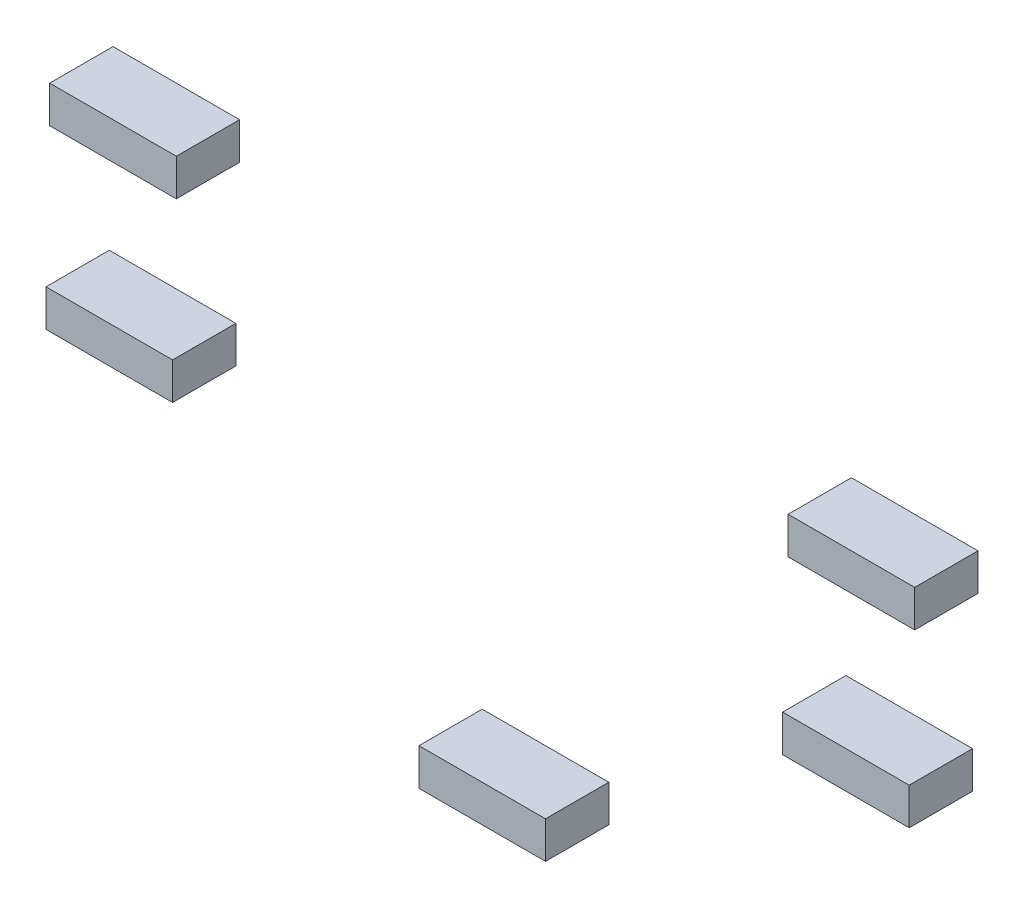
ISO-10303-21;
HEADER;
FILE_DESCRIPTION(('STEP AP214'),'2;1');
FILE_NAME('part.step','',(''),(''),'','','');
FILE_SCHEMA(('AUTOMOTIVE_DESIGN { 1 0 10303 214 1 1 1 1 }'));
ENDSEC;
DATA;
#1=APPLICATION_CONTEXT('core data for automotive mechanical design processes');
#2=APPLICATION_PROTOCOL_DEFINITION('international standard','automotive_design',2000,#1);
#3=PRODUCT_CONTEXT('',#1,'mechanical');
#4=PRODUCT('Part','Part','',(#3));
#5=PRODUCT_RELATED_PRODUCT_CATEGORY('part','',(#4));
#6=PRODUCT_DEFINITION_FORMATION('','',#4);
#7=PRODUCT_DEFINITION_CONTEXT('part definition',#1,'design');
#8=PRODUCT_DEFINITION('design','',#6,#7);
#9=PRODUCT_DEFINITION_SHAPE('','',#8);
#10=(LENGTH_UNIT() NAMED_UNIT(*) SI_UNIT(.MILLI.,.METRE.));
#11=(NAMED_UNIT(*) PLANE_ANGLE_UNIT() SI_UNIT($,.RADIAN.));
#12=(NAMED_UNIT(*) SI_UNIT($,.STERADIAN.) SOLID_ANGLE_UNIT());
#13=UNCERTAINTY_MEASURE_WITH_UNIT(LENGTH_MEASURE(1.E-05),#10,'distance_accuracy_value','');
#14=(GEOMETRIC_REPRESENTATION_CONTEXT(3) GLOBAL_UNCERTAINTY_ASSIGNED_CONTEXT((#13)) GLOBAL_UNIT_ASSIGNED_CONTEXT((#10,
#11,#12)) REPRESENTATION_CONTEXT('',''));
#15=CARTESIAN_POINT('',(0.,0.,0.));
#16=DIRECTION('',(0.,0.,1.));
#17=DIRECTION('',(1.,0.,0.));
#18=AXIS2_PLACEMENT_3D('',#15,#16,#17);
#19=CARTESIAN_POINT('',(62801.8191802713,25766.4437060881,600.));
#20=DIRECTION('',(1.,0.,0.));
#21=DIRECTION('',(0.,1.,0.));
#22=AXIS2_PLACEMENT_3D('',#19,#20,#21);
#23=PLANE('',#22);
#24=DIRECTION('',(0.,-1.,0.));
#25=VECTOR('',#24,1.);
#26=CARTESIAN_POINT('',(62801.8191802713,25766.4437060881,0.));
#27=LINE('',#26,#25);
#28=CARTESIAN_POINT('',(62801.8191802713,25766.4437060881,0.));
#29=VERTEX_POINT('',#28);
#30=CARTESIAN_POINT('',(62801.8191802713,25416.4437060881,0.));
#31=VERTEX_POINT('',#30);
#32=EDGE_CURVE('E105',#29,#31,#27,.T.);
#33=ORIENTED_EDGE('',*,*,#32,.T.);
#34=DIRECTION('',(0.,0.,-1.));
#35=VECTOR('',#34,1.);
#36=CARTESIAN_POINT('',(62801.8191802713,25416.4437060881,600.));
#37=LINE('',#36,#35);
#38=CARTESIAN_POINT('',(62801.8191802713,25416.4437060881,600.));
#39=VERTEX_POINT('',#38);
#40=EDGE_CURVE('E12',#39,#31,#37,.T.);
#41=ORIENTED_EDGE('',*,*,#40,.F.);
#42=DIRECTION('',(0.,-1.,0.));
#43=VECTOR('',#42,1.);
#44=CARTESIAN_POINT('',(62801.8191802713,25766.4437060881,600.));
#45=LINE('',#44,#43);
#46=CARTESIAN_POINT('',(62801.8191802713,25766.4437060881,600.));
#47=VERTEX_POINT('',#46);
#48=EDGE_CURVE('E93',#47,#39,#45,.T.);
#49=ORIENTED_EDGE('',*,*,#48,.F.);
#50=DIRECTION('',(0.,0.,-1.));
#51=VECTOR('',#50,1.);
#52=CARTESIAN_POINT('',(62801.8191802713,25766.4437060881,600.));
#53=LINE('',#52,#51);
#54=EDGE_CURVE('E101',#47,#29,#53,.T.);
#55=ORIENTED_EDGE('',*,*,#54,.T.);
#56=EDGE_LOOP('',(#33,#41,#49,#55));
#57=FACE_BOUND('',#56,.T.);
#58=ADVANCED_FACE('F42',(#57),#23,.F.);
#59=CARTESIAN_POINT('',(62801.8191802713,25416.4437060881,600.));
#60=DIRECTION('',(0.,1.,0.));
#61=DIRECTION('',(0.,0.,1.));
#62=AXIS2_PLACEMENT_3D('',#59,#60,#61);
#63=PLANE('',#62);
#64=DIRECTION('',(1.,0.,0.));
#65=VECTOR('',#64,1.);
#66=CARTESIAN_POINT('',(62801.8191802713,25416.4437060881,0.));
#67=LINE('',#66,#65);
#68=CARTESIAN_POINT('',(64001.8191802713,25416.4437060881,0.));
#69=VERTEX_POINT('',#68);
#70=EDGE_CURVE('E97',#31,#69,#67,.T.);
#71=ORIENTED_EDGE('',*,*,#70,.T.);
#72=DIRECTION('',(0.,0.,-1.));
#73=VECTOR('',#72,1.);
#74=CARTESIAN_POINT('',(64001.8191802713,25416.4437060881,600.));
#75=LINE('',#74,#73);
#76=CARTESIAN_POINT('',(64001.8191802713,25416.4437060881,600.));
#77=VERTEX_POINT('',#76);
#78=EDGE_CURVE('E50',#77,#69,#75,.T.);
#79=ORIENTED_EDGE('',*,*,#78,.F.);
#80=DIRECTION('',(1.,0.,0.));
#81=VECTOR('',#80,1.);
#82=CARTESIAN_POINT('',(62801.8191802713,25416.4437060881,600.));
#83=LINE('',#82,#81);
#84=EDGE_CURVE('E88',#39,#77,#83,.T.);
#85=ORIENTED_EDGE('',*,*,#84,.F.);
#86=ORIENTED_EDGE('',*,*,#40,.T.);
#87=EDGE_LOOP('',(#71,#79,#85,#86));
#88=FACE_BOUND('',#87,.T.);
#89=ADVANCED_FACE('F96',(#88),#63,.F.);
#90=CARTESIAN_POINT('',(64001.8191802713,25766.4437060881,600.));
#91=DIRECTION('',(-1.,0.,0.));
#92=DIRECTION('',(0.,0.,1.));
#93=AXIS2_PLACEMENT_3D('',#90,#91,#92);
#94=PLANE('',#93);
#95=DIRECTION('',(0.,1.,0.));
#96=VECTOR('',#95,1.);
#97=CARTESIAN_POINT('',(64001.8191802713,25766.4437060881,0.));
#98=LINE('',#97,#96);
#99=CARTESIAN_POINT('',(64001.8191802713,25766.4437060881,0.));
#100=VERTEX_POINT('',#99);
#101=EDGE_CURVE('E75',#69,#100,#98,.T.);
#102=ORIENTED_EDGE('',*,*,#101,.T.);
#103=DIRECTION('',(0.,0.,-1.));
#104=VECTOR('',#103,1.);
#105=CARTESIAN_POINT('',(64001.8191802713,25766.4437060881,600.));
#106=LINE('',#105,#104);
#107=CARTESIAN_POINT('',(64001.8191802713,25766.4437060881,600.));
#108=VERTEX_POINT('',#107);
#109=EDGE_CURVE('E98',#108,#100,#106,.T.);
#110=ORIENTED_EDGE('',*,*,#109,.F.);
#111=DIRECTION('',(0.,1.,0.));
#112=VECTOR('',#111,1.);
#113=CARTESIAN_POINT('',(64001.8191802713,25766.4437060881,600.));
#114=LINE('',#113,#112);
#115=EDGE_CURVE('E91',#77,#108,#114,.T.);
#116=ORIENTED_EDGE('',*,*,#115,.F.);
#117=ORIENTED_EDGE('',*,*,#78,.T.);
#118=EDGE_LOOP('',(#102,#110,#116,#117));
#119=FACE_BOUND('',#118,.T.);
#120=ADVANCED_FACE('F99',(#119),#94,.F.);
#121=CARTESIAN_POINT('',(62801.8191802713,25766.4437060881,600.));
#122=DIRECTION('',(0.,-1.,0.));
#123=DIRECTION('',(0.,0.,-1.));
#124=AXIS2_PLACEMENT_3D('',#121,#122,#123);
#125=PLANE('',#124);
#126=DIRECTION('',(-1.,0.,0.));
#127=VECTOR('',#126,1.);
#128=CARTESIAN_POINT('',(62801.8191802713,25766.4437060881,0.));
#129=LINE('',#128,#127);
#130=EDGE_CURVE('E81',#100,#29,#129,.T.);
#131=ORIENTED_EDGE('',*,*,#130,.T.);
#132=ORIENTED_EDGE('',*,*,#54,.F.);
#133=DIRECTION('',(-1.,0.,0.));
#134=VECTOR('',#133,1.);
#135=CARTESIAN_POINT('',(62801.8191802713,25766.4437060881,600.));
#136=LINE('',#135,#134);
#137=EDGE_CURVE('E58',#108,#47,#136,.T.);
#138=ORIENTED_EDGE('',*,*,#137,.F.);
#139=ORIENTED_EDGE('',*,*,#109,.T.);
#140=EDGE_LOOP('',(#131,#132,#138,#139));
#141=FACE_BOUND('',#140,.T.);
#142=ADVANCED_FACE('F112',(#141),#125,.F.);
#143=CARTESIAN_POINT('',(62801.8191802713,25416.4437060881,600.));
#144=DIRECTION('',(0.,0.,1.));
#145=DIRECTION('',(1.,0.,0.));
#146=AXIS2_PLACEMENT_3D('',#143,#144,#145);
#147=PLANE('',#146);
#148=ORIENTED_EDGE('',*,*,#48,.T.);
#149=ORIENTED_EDGE('',*,*,#84,.T.);
#150=ORIENTED_EDGE('',*,*,#115,.T.);
#151=ORIENTED_EDGE('',*,*,#137,.T.);
#152=EDGE_LOOP('',(#148,#149,#150,#151));
#153=FACE_BOUND('',#152,.T.);
#154=ADVANCED_FACE('F89',(#153),#147,.T.);
#155=CARTESIAN_POINT('',(62801.8191802713,25416.4437060881,0.));
#156=DIRECTION('',(0.,0.,1.));
#157=DIRECTION('',(1.,0.,0.));
#158=AXIS2_PLACEMENT_3D('',#155,#156,#157);
#159=PLANE('',#158);
#160=ORIENTED_EDGE('',*,*,#32,.F.);
#161=ORIENTED_EDGE('',*,*,#130,.F.);
#162=ORIENTED_EDGE('',*,*,#101,.F.);
#163=ORIENTED_EDGE('',*,*,#70,.F.);
#164=EDGE_LOOP('',(#160,#161,#162,#163));
#165=FACE_BOUND('',#164,.T.);
#166=ADVANCED_FACE('F115',(#165),#159,.F.);
#167=CLOSED_SHELL('',(#58,#89,#120,#142,#154,#166));
#168=MANIFOLD_SOLID_BREP('B2',#167);
#169=CARTESIAN_POINT('',(64037.0577376786,27106.1703648012,600.));
#170=DIRECTION('',(-1.,0.,0.));
#171=DIRECTION('',(0.,0.,1.));
#172=AXIS2_PLACEMENT_3D('',#169,#170,#171);
#173=PLANE('',#172);
#174=DIRECTION('',(0.,1.,0.));
#175=VECTOR('',#174,1.);
#176=CARTESIAN_POINT('',(64037.0577376786,27106.1703648012,0.));
#177=LINE('',#176,#175);
#178=CARTESIAN_POINT('',(64037.0577376786,27106.1703648012,0.));
#179=VERTEX_POINT('',#178);
#180=CARTESIAN_POINT('',(64037.0577376786,27456.1703648012,0.));
#181=VERTEX_POINT('',#180);
#182=EDGE_CURVE('E239',#179,#181,#177,.T.);
#183=ORIENTED_EDGE('',*,*,#182,.T.);
#184=DIRECTION('',(0.,0.,-1.));
#185=VECTOR('',#184,1.);
#186=CARTESIAN_POINT('',(64037.0577376786,27456.1703648012,600.));
#187=LINE('',#186,#185);
#188=CARTESIAN_POINT('',(64037.0577376786,27456.1703648012,600.));
#189=VERTEX_POINT('',#188);
#190=EDGE_CURVE('E40',#189,#181,#187,.T.);
#191=ORIENTED_EDGE('',*,*,#190,.F.);
#192=DIRECTION('',(0.,1.,0.));
#193=VECTOR('',#192,1.);
#194=CARTESIAN_POINT('',(64037.0577376786,27106.1703648012,600.));
#195=LINE('',#194,#193);
#196=CARTESIAN_POINT('',(64037.0577376786,27106.1703648012,600.));
#197=VERTEX_POINT('',#196);
#198=EDGE_CURVE('E227',#197,#189,#195,.T.);
#199=ORIENTED_EDGE('',*,*,#198,.F.);
#200=DIRECTION('',(0.,0.,-1.));
#201=VECTOR('',#200,1.);
#202=CARTESIAN_POINT('',(64037.0577376786,27106.1703648012,600.));
#203=LINE('',#202,#201);
#204=EDGE_CURVE('E235',#197,#179,#203,.T.);
#205=ORIENTED_EDGE('',*,*,#204,.T.);
#206=EDGE_LOOP('',(#183,#191,#199,#205));
#207=FACE_BOUND('',#206,.T.);
#208=ADVANCED_FACE('F176',(#207),#173,.F.);
#209=CARTESIAN_POINT('',(64037.0577376786,27456.1703648012,600.));
#210=DIRECTION('',(0.,-1.,0.));
#211=DIRECTION('',(0.,0.,-1.));
#212=AXIS2_PLACEMENT_3D('',#209,#210,#211);
#213=PLANE('',#212);
#214=DIRECTION('',(-1.,0.,0.));
#215=VECTOR('',#214,1.);
#216=CARTESIAN_POINT('',(64037.0577376786,27456.1703648012,0.));
#217=LINE('',#216,#215);
#218=CARTESIAN_POINT('',(62837.0577376786,27456.1703648012,0.));
#219=VERTEX_POINT('',#218);
#220=EDGE_CURVE('E231',#181,#219,#217,.T.);
#221=ORIENTED_EDGE('',*,*,#220,.T.);
#222=DIRECTION('',(0.,0.,-1.));
#223=VECTOR('',#222,1.);
#224=CARTESIAN_POINT('',(62837.0577376786,27456.1703648012,600.));
#225=LINE('',#224,#223);
#226=CARTESIAN_POINT('',(62837.0577376786,27456.1703648012,600.));
#227=VERTEX_POINT('',#226);
#228=EDGE_CURVE('E184',#227,#219,#225,.T.);
#229=ORIENTED_EDGE('',*,*,#228,.F.);
#230=DIRECTION('',(-1.,0.,0.));
#231=VECTOR('',#230,1.);
#232=CARTESIAN_POINT('',(64037.0577376786,27456.1703648012,600.));
#233=LINE('',#232,#231);
#234=EDGE_CURVE('E222',#189,#227,#233,.T.);
#235=ORIENTED_EDGE('',*,*,#234,.F.);
#236=ORIENTED_EDGE('',*,*,#190,.T.);
#237=EDGE_LOOP('',(#221,#229,#235,#236));
#238=FACE_BOUND('',#237,.T.);
#239=ADVANCED_FACE('F230',(#238),#213,.F.);
#240=CARTESIAN_POINT('',(62837.0577376786,27106.1703648012,600.));
#241=DIRECTION('',(1.,0.,0.));
#242=DIRECTION('',(0.,0.,-1.));
#243=AXIS2_PLACEMENT_3D('',#240,#241,#242);
#244=PLANE('',#243);
#245=DIRECTION('',(0.,-1.,0.));
#246=VECTOR('',#245,1.);
#247=CARTESIAN_POINT('',(62837.0577376786,27106.1703648012,0.));
#248=LINE('',#247,#246);
#249=CARTESIAN_POINT('',(62837.0577376786,27106.1703648012,0.));
#250=VERTEX_POINT('',#249);
#251=EDGE_CURVE('E209',#219,#250,#248,.T.);
#252=ORIENTED_EDGE('',*,*,#251,.T.);
#253=DIRECTION('',(0.,0.,-1.));
#254=VECTOR('',#253,1.);
#255=CARTESIAN_POINT('',(62837.0577376786,27106.1703648012,600.));
#256=LINE('',#255,#254);
#257=CARTESIAN_POINT('',(62837.0577376786,27106.1703648012,600.));
#258=VERTEX_POINT('',#257);
#259=EDGE_CURVE('E232',#258,#250,#256,.T.);
#260=ORIENTED_EDGE('',*,*,#259,.F.);
#261=DIRECTION('',(0.,-1.,0.));
#262=VECTOR('',#261,1.);
#263=CARTESIAN_POINT('',(62837.0577376786,27106.1703648012,600.));
#264=LINE('',#263,#262);
#265=EDGE_CURVE('E225',#227,#258,#264,.T.);
#266=ORIENTED_EDGE('',*,*,#265,.F.);
#267=ORIENTED_EDGE('',*,*,#228,.T.);
#268=EDGE_LOOP('',(#252,#260,#266,#267));
#269=FACE_BOUND('',#268,.T.);
#270=ADVANCED_FACE('F233',(#269),#244,.F.);
#271=CARTESIAN_POINT('',(64037.0577376786,27106.1703648012,600.));
#272=DIRECTION('',(0.,1.,0.));
#273=DIRECTION('',(0.,0.,1.));
#274=AXIS2_PLACEMENT_3D('',#271,#272,#273);
#275=PLANE('',#274);
#276=DIRECTION('',(1.,0.,0.));
#277=VECTOR('',#276,1.);
#278=CARTESIAN_POINT('',(64037.0577376786,27106.1703648012,0.));
#279=LINE('',#278,#277);
#280=EDGE_CURVE('E215',#250,#179,#279,.T.);
#281=ORIENTED_EDGE('',*,*,#280,.T.);
#282=ORIENTED_EDGE('',*,*,#204,.F.);
#283=DIRECTION('',(1.,0.,0.));
#284=VECTOR('',#283,1.);
#285=CARTESIAN_POINT('',(64037.0577376786,27106.1703648012,600.));
#286=LINE('',#285,#284);
#287=EDGE_CURVE('E192',#258,#197,#286,.T.);
#288=ORIENTED_EDGE('',*,*,#287,.F.);
#289=ORIENTED_EDGE('',*,*,#259,.T.);
#290=EDGE_LOOP('',(#281,#282,#288,#289));
#291=FACE_BOUND('',#290,.T.);
#292=ADVANCED_FACE('F246',(#291),#275,.F.);
#293=CARTESIAN_POINT('',(64037.0577376786,27456.1703648012,600.));
#294=DIRECTION('',(0.,0.,1.));
#295=DIRECTION('',(1.,0.,0.));
#296=AXIS2_PLACEMENT_3D('',#293,#294,#295);
#297=PLANE('',#296);
#298=ORIENTED_EDGE('',*,*,#198,.T.);
#299=ORIENTED_EDGE('',*,*,#234,.T.);
#300=ORIENTED_EDGE('',*,*,#265,.T.);
#301=ORIENTED_EDGE('',*,*,#287,.T.);
#302=EDGE_LOOP('',(#298,#299,#300,#301));
#303=FACE_BOUND('',#302,.T.);
#304=ADVANCED_FACE('F223',(#303),#297,.T.);
#305=CARTESIAN_POINT('',(64037.0577376786,27456.1703648012,0.));
#306=DIRECTION('',(0.,0.,1.));
#307=DIRECTION('',(1.,0.,0.));
#308=AXIS2_PLACEMENT_3D('',#305,#306,#307);
#309=PLANE('',#308);
#310=ORIENTED_EDGE('',*,*,#182,.F.);
#311=ORIENTED_EDGE('',*,*,#280,.F.);
#312=ORIENTED_EDGE('',*,*,#251,.F.);
#313=ORIENTED_EDGE('',*,*,#220,.F.);
#314=EDGE_LOOP('',(#310,#311,#312,#313));
#315=FACE_BOUND('',#314,.T.);
#316=ADVANCED_FACE('F249',(#315),#309,.F.);
#317=CLOSED_SHELL('',(#208,#239,#270,#292,#304,#316));
#318=MANIFOLD_SOLID_BREP('B6',#317);
#319=CARTESIAN_POINT('',(71037.0577376786,27066.6336256256,600.));
#320=DIRECTION('',(-1.,0.,0.));
#321=DIRECTION('',(0.,-1.,0.));
#322=AXIS2_PLACEMENT_3D('',#319,#320,#321);
#323=PLANE('',#322);
#324=DIRECTION('',(0.,1.,0.));
#325=VECTOR('',#324,1.);
#326=CARTESIAN_POINT('',(71037.0577376786,27066.6336256256,0.));
#327=LINE('',#326,#325);
#328=CARTESIAN_POINT('',(71037.0577376786,27066.6336256256,0.));
#329=VERTEX_POINT('',#328);
#330=CARTESIAN_POINT('',(71037.0577376786,27416.6336256256,0.));
#331=VERTEX_POINT('',#330);
#332=EDGE_CURVE('E373',#329,#331,#327,.T.);
#333=ORIENTED_EDGE('',*,*,#332,.T.);
#334=DIRECTION('',(0.,0.,-1.));
#335=VECTOR('',#334,1.);
#336=CARTESIAN_POINT('',(71037.0577376786,27416.6336256256,600.));
#337=LINE('',#336,#335);
#338=CARTESIAN_POINT('',(71037.0577376786,27416.6336256256,600.));
#339=VERTEX_POINT('',#338);
#340=EDGE_CURVE('E174',#339,#331,#337,.T.);
#341=ORIENTED_EDGE('',*,*,#340,.F.);
#342=DIRECTION('',(0.,1.,0.));
#343=VECTOR('',#342,1.);
#344=CARTESIAN_POINT('',(71037.0577376786,27066.6336256256,600.));
#345=LINE('',#344,#343);
#346=CARTESIAN_POINT('',(71037.0577376786,27066.6336256256,600.));
#347=VERTEX_POINT('',#346);
#348=EDGE_CURVE('E361',#347,#339,#345,.T.);
#349=ORIENTED_EDGE('',*,*,#348,.F.);
#350=DIRECTION('',(0.,0.,-1.));
#351=VECTOR('',#350,1.);
#352=CARTESIAN_POINT('',(71037.0577376786,27066.6336256256,600.));
#353=LINE('',#352,#351);
#354=EDGE_CURVE('E369',#347,#329,#353,.T.);
#355=ORIENTED_EDGE('',*,*,#354,.T.);
#356=EDGE_LOOP('',(#333,#341,#349,#355));
#357=FACE_BOUND('',#356,.T.);
#358=ADVANCED_FACE('F310',(#357),#323,.F.);
#359=CARTESIAN_POINT('',(71037.0577376786,27416.6336256256,600.));
#360=DIRECTION('',(0.,-1.,0.));
#361=DIRECTION('',(0.,0.,-1.));
#362=AXIS2_PLACEMENT_3D('',#359,#360,#361);
#363=PLANE('',#362);
#364=DIRECTION('',(-1.,0.,0.));
#365=VECTOR('',#364,1.);
#366=CARTESIAN_POINT('',(71037.0577376786,27416.6336256256,0.));
#367=LINE('',#366,#365);
#368=CARTESIAN_POINT('',(69837.0577376786,27416.6336256256,0.));
#369=VERTEX_POINT('',#368);
#370=EDGE_CURVE('E365',#331,#369,#367,.T.);
#371=ORIENTED_EDGE('',*,*,#370,.T.);
#372=DIRECTION('',(0.,0.,-1.));
#373=VECTOR('',#372,1.);
#374=CARTESIAN_POINT('',(69837.0577376786,27416.6336256256,600.));
#375=LINE('',#374,#373);
#376=CARTESIAN_POINT('',(69837.0577376786,27416.6336256256,600.));
#377=VERTEX_POINT('',#376);
#378=EDGE_CURVE('E318',#377,#369,#375,.T.);
#379=ORIENTED_EDGE('',*,*,#378,.F.);
#380=DIRECTION('',(-1.,0.,0.));
#381=VECTOR('',#380,1.);
#382=CARTESIAN_POINT('',(71037.0577376786,27416.6336256256,600.));
#383=LINE('',#382,#381);
#384=EDGE_CURVE('E356',#339,#377,#383,.T.);
#385=ORIENTED_EDGE('',*,*,#384,.F.);
#386=ORIENTED_EDGE('',*,*,#340,.T.);
#387=EDGE_LOOP('',(#371,#379,#385,#386));
#388=FACE_BOUND('',#387,.T.);
#389=ADVANCED_FACE('F364',(#388),#363,.F.);
#390=CARTESIAN_POINT('',(69837.0577376786,27066.6336256256,600.));
#391=DIRECTION('',(1.,0.,0.));
#392=DIRECTION('',(0.,1.,0.));
#393=AXIS2_PLACEMENT_3D('',#390,#391,#392);
#394=PLANE('',#393);
#395=DIRECTION('',(0.,-1.,0.));
#396=VECTOR('',#395,1.);
#397=CARTESIAN_POINT('',(69837.0577376786,27066.6336256256,0.));
#398=LINE('',#397,#396);
#399=CARTESIAN_POINT('',(69837.0577376786,27066.6336256256,0.));
#400=VERTEX_POINT('',#399);
#401=EDGE_CURVE('E343',#369,#400,#398,.T.);
#402=ORIENTED_EDGE('',*,*,#401,.T.);
#403=DIRECTION('',(0.,0.,-1.));
#404=VECTOR('',#403,1.);
#405=CARTESIAN_POINT('',(69837.0577376786,27066.6336256256,600.));
#406=LINE('',#405,#404);
#407=CARTESIAN_POINT('',(69837.0577376786,27066.6336256256,600.));
#408=VERTEX_POINT('',#407);
#409=EDGE_CURVE('E366',#408,#400,#406,.T.);
#410=ORIENTED_EDGE('',*,*,#409,.F.);
#411=DIRECTION('',(0.,-1.,0.));
#412=VECTOR('',#411,1.);
#413=CARTESIAN_POINT('',(69837.0577376786,27066.6336256256,600.));
#414=LINE('',#413,#412);
#415=EDGE_CURVE('E359',#377,#408,#414,.T.);
#416=ORIENTED_EDGE('',*,*,#415,.F.);
#417=ORIENTED_EDGE('',*,*,#378,.T.);
#418=EDGE_LOOP('',(#402,#410,#416,#417));
#419=FACE_BOUND('',#418,.T.);
#420=ADVANCED_FACE('F367',(#419),#394,.F.);
#421=CARTESIAN_POINT('',(71037.0577376786,27066.6336256256,600.));
#422=DIRECTION('',(0.,1.,0.));
#423=DIRECTION('',(0.,0.,1.));
#424=AXIS2_PLACEMENT_3D('',#421,#422,#423);
#425=PLANE('',#424);
#426=DIRECTION('',(1.,0.,0.));
#427=VECTOR('',#426,1.);
#428=CARTESIAN_POINT('',(71037.0577376786,27066.6336256256,0.));
#429=LINE('',#428,#427);
#430=EDGE_CURVE('E349',#400,#329,#429,.T.);
#431=ORIENTED_EDGE('',*,*,#430,.T.);
#432=ORIENTED_EDGE('',*,*,#354,.F.);
#433=DIRECTION('',(1.,0.,0.));
#434=VECTOR('',#433,1.);
#435=CARTESIAN_POINT('',(71037.0577376786,27066.6336256256,600.));
#436=LINE('',#435,#434);
#437=EDGE_CURVE('E326',#408,#347,#436,.T.);
#438=ORIENTED_EDGE('',*,*,#437,.F.);
#439=ORIENTED_EDGE('',*,*,#409,.T.);
#440=EDGE_LOOP('',(#431,#432,#438,#439));
#441=FACE_BOUND('',#440,.T.);
#442=ADVANCED_FACE('F380',(#441),#425,.F.);
#443=CARTESIAN_POINT('',(71037.0577376786,27416.6336256256,600.));
#444=DIRECTION('',(0.,0.,1.));
#445=DIRECTION('',(1.,0.,0.));
#446=AXIS2_PLACEMENT_3D('',#443,#444,#445);
#447=PLANE('',#446);
#448=ORIENTED_EDGE('',*,*,#348,.T.);
#449=ORIENTED_EDGE('',*,*,#384,.T.);
#450=ORIENTED_EDGE('',*,*,#415,.T.);
#451=ORIENTED_EDGE('',*,*,#437,.T.);
#452=EDGE_LOOP('',(#448,#449,#450,#451));
#453=FACE_BOUND('',#452,.T.);
#454=ADVANCED_FACE('F357',(#453),#447,.T.);
#455=CARTESIAN_POINT('',(71037.0577376786,27416.6336256256,0.));
#456=DIRECTION('',(0.,0.,1.));
#457=DIRECTION('',(1.,0.,0.));
#458=AXIS2_PLACEMENT_3D('',#455,#456,#457);
#459=PLANE('',#458);
#460=ORIENTED_EDGE('',*,*,#332,.F.);
#461=ORIENTED_EDGE('',*,*,#430,.F.);
#462=ORIENTED_EDGE('',*,*,#401,.F.);
#463=ORIENTED_EDGE('',*,*,#370,.F.);
#464=EDGE_LOOP('',(#460,#461,#462,#463));
#465=FACE_BOUND('',#464,.T.);
#466=ADVANCED_FACE('F383',(#465),#459,.F.);
#467=CLOSED_SHELL('',(#358,#389,#420,#442,#454,#466));
#468=MANIFOLD_SOLID_BREP('B34',#467);
#469=CARTESIAN_POINT('',(69785.142636984,25766.6336256256,600.));
#470=DIRECTION('',(1.,0.,0.));
#471=DIRECTION('',(0.,0.,-1.));
#472=AXIS2_PLACEMENT_3D('',#469,#470,#471);
#473=PLANE('',#472);
#474=DIRECTION('',(0.,-1.,0.));
#475=VECTOR('',#474,1.);
#476=CARTESIAN_POINT('',(69785.142636984,25766.6336256256,0.));
#477=LINE('',#476,#475);
#478=CARTESIAN_POINT('',(69785.142636984,25766.6336256256,0.));
#479=VERTEX_POINT('',#478);
#480=CARTESIAN_POINT('',(69785.142636984,25416.6336256256,0.));
#481=VERTEX_POINT('',#480);
#482=EDGE_CURVE('E506',#479,#481,#477,.T.);
#483=ORIENTED_EDGE('',*,*,#482,.T.);
#484=DIRECTION('',(0.,0.,-1.));
#485=VECTOR('',#484,1.);
#486=CARTESIAN_POINT('',(69785.142636984,25416.6336256256,600.));
#487=LINE('',#486,#485);
#488=CARTESIAN_POINT('',(69785.142636984,25416.6336256256,600.));
#489=VERTEX_POINT('',#488);
#490=EDGE_CURVE('E308',#489,#481,#487,.T.);
#491=ORIENTED_EDGE('',*,*,#490,.F.);
#492=DIRECTION('',(0.,-1.,0.));
#493=VECTOR('',#492,1.);
#494=CARTESIAN_POINT('',(69785.142636984,25766.6336256256,600.));
#495=LINE('',#494,#493);
#496=CARTESIAN_POINT('',(69785.142636984,25766.6336256256,600.));
#497=VERTEX_POINT('',#496);
#498=EDGE_CURVE('E494',#497,#489,#495,.T.);
#499=ORIENTED_EDGE('',*,*,#498,.F.);
#500=DIRECTION('',(0.,0.,-1.));
#501=VECTOR('',#500,1.);
#502=CARTESIAN_POINT('',(69785.142636984,25766.6336256256,600.));
#503=LINE('',#502,#501);
#504=EDGE_CURVE('E502',#497,#479,#503,.T.);
#505=ORIENTED_EDGE('',*,*,#504,.T.);
#506=EDGE_LOOP('',(#483,#491,#499,#505));
#507=FACE_BOUND('',#506,.T.);
#508=ADVANCED_FACE('F443',(#507),#473,.F.);
#509=CARTESIAN_POINT('',(69785.142636984,25416.6336256256,600.));
#510=DIRECTION('',(0.,1.,0.));
#511=DIRECTION('',(0.,0.,1.));
#512=AXIS2_PLACEMENT_3D('',#509,#510,#511);
#513=PLANE('',#512);
#514=DIRECTION('',(1.,0.,0.));
#515=VECTOR('',#514,1.);
#516=CARTESIAN_POINT('',(69785.142636984,25416.6336256256,0.));
#517=LINE('',#516,#515);
#518=CARTESIAN_POINT('',(70985.142636984,25416.6336256256,0.));
#519=VERTEX_POINT('',#518);
#520=EDGE_CURVE('E498',#481,#519,#517,.T.);
#521=ORIENTED_EDGE('',*,*,#520,.T.);
#522=DIRECTION('',(0.,0.,-1.));
#523=VECTOR('',#522,1.);
#524=CARTESIAN_POINT('',(70985.142636984,25416.6336256256,600.));
#525=LINE('',#524,#523);
#526=CARTESIAN_POINT('',(70985.142636984,25416.6336256256,600.));
#527=VERTEX_POINT('',#526);
#528=EDGE_CURVE('E451',#527,#519,#525,.T.);
#529=ORIENTED_EDGE('',*,*,#528,.F.);
#530=DIRECTION('',(1.,0.,0.));
#531=VECTOR('',#530,1.);
#532=CARTESIAN_POINT('',(69785.142636984,25416.6336256256,600.));
#533=LINE('',#532,#531);
#534=EDGE_CURVE('E489',#489,#527,#533,.T.);
#535=ORIENTED_EDGE('',*,*,#534,.F.);
#536=ORIENTED_EDGE('',*,*,#490,.T.);
#537=EDGE_LOOP('',(#521,#529,#535,#536));
#538=FACE_BOUND('',#537,.T.);
#539=ADVANCED_FACE('F497',(#538),#513,.F.);
#540=CARTESIAN_POINT('',(70985.142636984,25766.6336256256,600.));
#541=DIRECTION('',(-1.,0.,0.));
#542=DIRECTION('',(0.,0.,1.));
#543=AXIS2_PLACEMENT_3D('',#540,#541,#542);
#544=PLANE('',#543);
#545=DIRECTION('',(0.,1.,0.));
#546=VECTOR('',#545,1.);
#547=CARTESIAN_POINT('',(70985.142636984,25766.6336256256,0.));
#548=LINE('',#547,#546);
#549=CARTESIAN_POINT('',(70985.142636984,25766.6336256256,0.));
#550=VERTEX_POINT('',#549);
#551=EDGE_CURVE('E476',#519,#550,#548,.T.);
#552=ORIENTED_EDGE('',*,*,#551,.T.);
#553=DIRECTION('',(0.,0.,-1.));
#554=VECTOR('',#553,1.);
#555=CARTESIAN_POINT('',(70985.142636984,25766.6336256256,600.));
#556=LINE('',#555,#554);
#557=CARTESIAN_POINT('',(70985.142636984,25766.6336256256,600.));
#558=VERTEX_POINT('',#557);
#559=EDGE_CURVE('E499',#558,#550,#556,.T.);
#560=ORIENTED_EDGE('',*,*,#559,.F.);
#561=DIRECTION('',(0.,1.,0.));
#562=VECTOR('',#561,1.);
#563=CARTESIAN_POINT('',(70985.142636984,25766.6336256256,600.));
#564=LINE('',#563,#562);
#565=EDGE_CURVE('E492',#527,#558,#564,.T.);
#566=ORIENTED_EDGE('',*,*,#565,.F.);
#567=ORIENTED_EDGE('',*,*,#528,.T.);
#568=EDGE_LOOP('',(#552,#560,#566,#567));
#569=FACE_BOUND('',#568,.T.);
#570=ADVANCED_FACE('F500',(#569),#544,.F.);
#571=CARTESIAN_POINT('',(69785.142636984,25766.6336256256,600.));
#572=DIRECTION('',(0.,-1.,0.));
#573=DIRECTION('',(0.,0.,-1.));
#574=AXIS2_PLACEMENT_3D('',#571,#572,#573);
#575=PLANE('',#574);
#576=DIRECTION('',(-1.,0.,0.));
#577=VECTOR('',#576,1.);
#578=CARTESIAN_POINT('',(69785.142636984,25766.6336256256,0.));
#579=LINE('',#578,#577);
#580=EDGE_CURVE('E482',#550,#479,#579,.T.);
#581=ORIENTED_EDGE('',*,*,#580,.T.);
#582=ORIENTED_EDGE('',*,*,#504,.F.);
#583=DIRECTION('',(-1.,0.,0.));
#584=VECTOR('',#583,1.);
#585=CARTESIAN_POINT('',(69785.142636984,25766.6336256256,600.));
#586=LINE('',#585,#584);
#587=EDGE_CURVE('E459',#558,#497,#586,.T.);
#588=ORIENTED_EDGE('',*,*,#587,.F.);
#589=ORIENTED_EDGE('',*,*,#559,.T.);
#590=EDGE_LOOP('',(#581,#582,#588,#589));
#591=FACE_BOUND('',#590,.T.);
#592=ADVANCED_FACE('F513',(#591),#575,.F.);
#593=CARTESIAN_POINT('',(69785.142636984,25416.6336256256,600.));
#594=DIRECTION('',(0.,0.,1.));
#595=DIRECTION('',(1.,0.,0.));
#596=AXIS2_PLACEMENT_3D('',#593,#594,#595);
#597=PLANE('',#596);
#598=ORIENTED_EDGE('',*,*,#498,.T.);
#599=ORIENTED_EDGE('',*,*,#534,.T.);
#600=ORIENTED_EDGE('',*,*,#565,.T.);
#601=ORIENTED_EDGE('',*,*,#587,.T.);
#602=EDGE_LOOP('',(#598,#599,#600,#601));
#603=FACE_BOUND('',#602,.T.);
#604=ADVANCED_FACE('F490',(#603),#597,.T.);
#605=CARTESIAN_POINT('',(69785.142636984,25416.6336256256,0.));
#606=DIRECTION('',(0.,0.,1.));
#607=DIRECTION('',(1.,0.,0.));
#608=AXIS2_PLACEMENT_3D('',#605,#606,#607);
#609=PLANE('',#608);
#610=ORIENTED_EDGE('',*,*,#482,.F.);
#611=ORIENTED_EDGE('',*,*,#580,.F.);
#612=ORIENTED_EDGE('',*,*,#551,.F.);
#613=ORIENTED_EDGE('',*,*,#520,.F.);
#614=EDGE_LOOP('',(#610,#611,#612,#613));
#615=FACE_BOUND('',#614,.T.);
#616=ADVANCED_FACE('F516',(#615),#609,.F.);
#617=CLOSED_SHELL('',(#508,#539,#570,#592,#604,#616));
#618=MANIFOLD_SOLID_BREP('B168',#617);
#619=CARTESIAN_POINT('',(66337.0577376786,23766.6336256256,600.));
#620=DIRECTION('',(1.,0.,0.));
#621=DIRECTION('',(0.,0.,-1.));
#622=AXIS2_PLACEMENT_3D('',#619,#620,#621);
#623=PLANE('',#622);
#624=DIRECTION('',(0.,-1.,0.));
#625=VECTOR('',#624,1.);
#626=CARTESIAN_POINT('',(66337.0577376786,23766.6336256256,0.));
#627=LINE('',#626,#625);
#628=CARTESIAN_POINT('',(66337.0577376786,23766.6336256256,0.));
#629=VERTEX_POINT('',#628);
#630=CARTESIAN_POINT('',(66337.0577376786,23416.6336256256,0.));
#631=VERTEX_POINT('',#630);
#632=EDGE_CURVE('E630',#629,#631,#627,.T.);
#633=ORIENTED_EDGE('',*,*,#632,.T.);
#634=DIRECTION('',(0.,0.,-1.));
#635=VECTOR('',#634,1.);
#636=CARTESIAN_POINT('',(66337.0577376786,23416.6336256256,600.));
#637=LINE('',#636,#635);
#638=CARTESIAN_POINT('',(66337.0577376786,23416.6336256256,600.));
#639=VERTEX_POINT('',#638);
#640=EDGE_CURVE('E441',#639,#631,#637,.T.);
#641=ORIENTED_EDGE('',*,*,#640,.F.);
#642=DIRECTION('',(0.,-1.,0.));
#643=VECTOR('',#642,1.);
#644=CARTESIAN_POINT('',(66337.0577376786,23766.6336256256,600.));
#645=LINE('',#644,#643);
#646=CARTESIAN_POINT('',(66337.0577376786,23766.6336256256,600.));
#647=VERTEX_POINT('',#646);
#648=EDGE_CURVE('E618',#647,#639,#645,.T.);
#649=ORIENTED_EDGE('',*,*,#648,.F.);
#650=DIRECTION('',(0.,0.,-1.));
#651=VECTOR('',#650,1.);
#652=CARTESIAN_POINT('',(66337.0577376786,23766.6336256256,600.));
#653=LINE('',#652,#651);
#654=EDGE_CURVE('E626',#647,#629,#653,.T.);
#655=ORIENTED_EDGE('',*,*,#654,.T.);
#656=EDGE_LOOP('',(#633,#641,#649,#655));
#657=FACE_BOUND('',#656,.T.);
#658=ADVANCED_FACE('F567',(#657),#623,.F.);
#659=CARTESIAN_POINT('',(66337.0577376786,23416.6336256256,600.));
#660=DIRECTION('',(0.,1.,0.));
#661=DIRECTION('',(0.,0.,1.));
#662=AXIS2_PLACEMENT_3D('',#659,#660,#661);
#663=PLANE('',#662);
#664=DIRECTION('',(1.,0.,0.));
#665=VECTOR('',#664,1.);
#666=CARTESIAN_POINT('',(66337.0577376786,23416.6336256256,0.));
#667=LINE('',#666,#665);
#668=CARTESIAN_POINT('',(67537.0577376786,23416.6336256256,0.));
#669=VERTEX_POINT('',#668);
#670=EDGE_CURVE('E622',#631,#669,#667,.T.);
#671=ORIENTED_EDGE('',*,*,#670,.T.);
#672=DIRECTION('',(0.,0.,-1.));
#673=VECTOR('',#672,1.);
#674=CARTESIAN_POINT('',(67537.0577376786,23416.6336256256,600.));
#675=LINE('',#674,#673);
#676=CARTESIAN_POINT('',(67537.0577376786,23416.6336256256,600.));
#677=VERTEX_POINT('',#676);
#678=EDGE_CURVE('E575',#677,#669,#675,.T.);
#679=ORIENTED_EDGE('',*,*,#678,.F.);
#680=DIRECTION('',(1.,0.,0.));
#681=VECTOR('',#680,1.);
#682=CARTESIAN_POINT('',(66337.0577376786,23416.6336256256,600.));
#683=LINE('',#682,#681);
#684=EDGE_CURVE('E613',#639,#677,#683,.T.);
#685=ORIENTED_EDGE('',*,*,#684,.F.);
#686=ORIENTED_EDGE('',*,*,#640,.T.);
#687=EDGE_LOOP('',(#671,#679,#685,#686));
#688=FACE_BOUND('',#687,.T.);
#689=ADVANCED_FACE('F621',(#688),#663,.F.);
#690=CARTESIAN_POINT('',(67537.0577376786,23766.6336256256,600.));
#691=DIRECTION('',(-1.,0.,0.));
#692=DIRECTION('',(0.,0.,1.));
#693=AXIS2_PLACEMENT_3D('',#690,#691,#692);
#694=PLANE('',#693);
#695=DIRECTION('',(0.,1.,0.));
#696=VECTOR('',#695,1.);
#697=CARTESIAN_POINT('',(67537.0577376786,23766.6336256256,0.));
#698=LINE('',#697,#696);
#699=CARTESIAN_POINT('',(67537.0577376786,23766.6336256256,0.));
#700=VERTEX_POINT('',#699);
#701=EDGE_CURVE('E600',#669,#700,#698,.T.);
#702=ORIENTED_EDGE('',*,*,#701,.T.);
#703=DIRECTION('',(0.,0.,-1.));
#704=VECTOR('',#703,1.);
#705=CARTESIAN_POINT('',(67537.0577376786,23766.6336256256,600.));
#706=LINE('',#705,#704);
#707=CARTESIAN_POINT('',(67537.0577376786,23766.6336256256,600.));
#708=VERTEX_POINT('',#707);
#709=EDGE_CURVE('E623',#708,#700,#706,.T.);
#710=ORIENTED_EDGE('',*,*,#709,.F.);
#711=DIRECTION('',(0.,1.,0.));
#712=VECTOR('',#711,1.);
#713=CARTESIAN_POINT('',(67537.0577376786,23766.6336256256,600.));
#714=LINE('',#713,#712);
#715=EDGE_CURVE('E616',#677,#708,#714,.T.);
#716=ORIENTED_EDGE('',*,*,#715,.F.);
#717=ORIENTED_EDGE('',*,*,#678,.T.);
#718=EDGE_LOOP('',(#702,#710,#716,#717));
#719=FACE_BOUND('',#718,.T.);
#720=ADVANCED_FACE('F624',(#719),#694,.F.);
#721=CARTESIAN_POINT('',(66337.0577376786,23766.6336256256,600.));
#722=DIRECTION('',(0.,-1.,0.));
#723=DIRECTION('',(0.,0.,-1.));
#724=AXIS2_PLACEMENT_3D('',#721,#722,#723);
#725=PLANE('',#724);
#726=DIRECTION('',(-1.,0.,0.));
#727=VECTOR('',#726,1.);
#728=CARTESIAN_POINT('',(66337.0577376786,23766.6336256256,0.));
#729=LINE('',#728,#727);
#730=EDGE_CURVE('E606',#700,#629,#729,.T.);
#731=ORIENTED_EDGE('',*,*,#730,.T.);
#732=ORIENTED_EDGE('',*,*,#654,.F.);
#733=DIRECTION('',(-1.,0.,0.));
#734=VECTOR('',#733,1.);
#735=CARTESIAN_POINT('',(66337.0577376786,23766.6336256256,600.));
#736=LINE('',#735,#734);
#737=EDGE_CURVE('E583',#708,#647,#736,.T.);
#738=ORIENTED_EDGE('',*,*,#737,.F.);
#739=ORIENTED_EDGE('',*,*,#709,.T.);
#740=EDGE_LOOP('',(#731,#732,#738,#739));
#741=FACE_BOUND('',#740,.T.);
#742=ADVANCED_FACE('F637',(#741),#725,.F.);
#743=CARTESIAN_POINT('',(66337.0577376786,23416.6336256256,600.));
#744=DIRECTION('',(0.,0.,1.));
#745=DIRECTION('',(1.,0.,0.));
#746=AXIS2_PLACEMENT_3D('',#743,#744,#745);
#747=PLANE('',#746);
#748=ORIENTED_EDGE('',*,*,#648,.T.);
#749=ORIENTED_EDGE('',*,*,#684,.T.);
#750=ORIENTED_EDGE('',*,*,#715,.T.);
#751=ORIENTED_EDGE('',*,*,#737,.T.);
#752=EDGE_LOOP('',(#748,#749,#750,#751));
#753=FACE_BOUND('',#752,.T.);
#754=ADVANCED_FACE('F614',(#753),#747,.T.);
#755=CARTESIAN_POINT('',(66337.0577376786,23416.6336256256,0.));
#756=DIRECTION('',(0.,0.,1.));
#757=DIRECTION('',(1.,0.,0.));
#758=AXIS2_PLACEMENT_3D('',#755,#756,#757);
#759=PLANE('',#758);
#760=ORIENTED_EDGE('',*,*,#632,.F.);
#761=ORIENTED_EDGE('',*,*,#730,.F.);
#762=ORIENTED_EDGE('',*,*,#701,.F.);
#763=ORIENTED_EDGE('',*,*,#670,.F.);
#764=EDGE_LOOP('',(#760,#761,#762,#763));
#765=FACE_BOUND('',#764,.T.);
#766=ADVANCED_FACE('F640',(#765),#759,.F.);
#767=CLOSED_SHELL('',(#658,#689,#720,#742,#754,#766));
#768=MANIFOLD_SOLID_BREP('B302',#767);
#769=ADVANCED_BREP_SHAPE_REPRESENTATION('',(#18,#168,#318,#468,#618,#768),#14);
#770=SHAPE_DEFINITION_REPRESENTATION(#9,#769);
ENDSEC;
END-ISO-10303-21;
